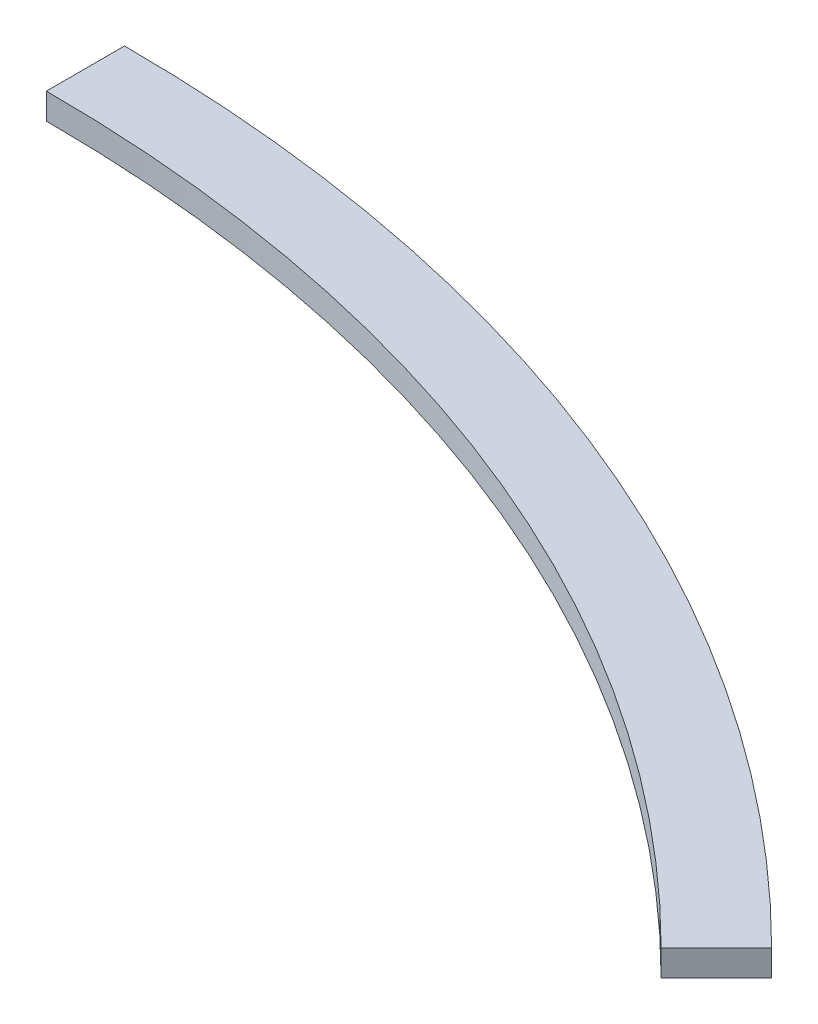
ISO-10303-21;
HEADER;
FILE_DESCRIPTION(('STEP AP214'),'2;1');
FILE_NAME('part.step','',(''),(''),'','','');
FILE_SCHEMA(('AUTOMOTIVE_DESIGN { 1 0 10303 214 1 1 1 1 }'));
ENDSEC;
DATA;
#1=APPLICATION_CONTEXT('core data for automotive mechanical design processes');
#2=APPLICATION_PROTOCOL_DEFINITION('international standard','automotive_design',2000,#1);
#3=PRODUCT_CONTEXT('',#1,'mechanical');
#4=PRODUCT('Part','Part','',(#3));
#5=PRODUCT_RELATED_PRODUCT_CATEGORY('part','',(#4));
#6=PRODUCT_DEFINITION_FORMATION('','',#4);
#7=PRODUCT_DEFINITION_CONTEXT('part definition',#1,'design');
#8=PRODUCT_DEFINITION('design','',#6,#7);
#9=PRODUCT_DEFINITION_SHAPE('','',#8);
#10=(LENGTH_UNIT() NAMED_UNIT(*) SI_UNIT(.MILLI.,.METRE.));
#11=(NAMED_UNIT(*) PLANE_ANGLE_UNIT() SI_UNIT($,.RADIAN.));
#12=(NAMED_UNIT(*) SI_UNIT($,.STERADIAN.) SOLID_ANGLE_UNIT());
#13=UNCERTAINTY_MEASURE_WITH_UNIT(LENGTH_MEASURE(1.E-05),#10,'distance_accuracy_value','');
#14=(GEOMETRIC_REPRESENTATION_CONTEXT(3) GLOBAL_UNCERTAINTY_ASSIGNED_CONTEXT((#13)) GLOBAL_UNIT_ASSIGNED_CONTEXT((#10,
#11,#12)) REPRESENTATION_CONTEXT('',''));
#15=CARTESIAN_POINT('',(0.,0.,0.));
#16=DIRECTION('',(0.,0.,1.));
#17=DIRECTION('',(1.,0.,0.));
#18=AXIS2_PLACEMENT_3D('',#15,#16,#17);
#19=CARTESIAN_POINT('',(0.,10.,0.));
#20=DIRECTION('',(0.,-1.,0.));
#21=DIRECTION('',(0.,0.,-1.));
#22=AXIS2_PLACEMENT_3D('',#19,#20,#21);
#23=CYLINDRICAL_SURFACE('',#22,570.);
#24=CARTESIAN_POINT('',(0.,0.,0.));
#25=DIRECTION('',(0.,-1.,0.));
#26=DIRECTION('',(0.,0.,-1.));
#27=AXIS2_PLACEMENT_3D('',#24,#25,#26);
#28=CIRCLE('',#27,570.);
#29=CARTESIAN_POINT('',(0.,0.,-570.));
#30=VERTEX_POINT('',#29);
#31=CARTESIAN_POINT('',(403.050865276333,0.,-403.050865276331));
#32=VERTEX_POINT('',#31);
#33=EDGE_CURVE('E97',#30,#32,#28,.T.);
#34=ORIENTED_EDGE('',*,*,#33,.T.);
#35=DIRECTION('',(0.,-1.,0.));
#36=VECTOR('',#35,1.);
#37=CARTESIAN_POINT('',(403.050865276333,10.,-403.050865276331));
#38=LINE('',#37,#36);
#39=CARTESIAN_POINT('',(403.050865276333,10.,-403.050865276331));
#40=VERTEX_POINT('',#39);
#41=EDGE_CURVE('E11',#40,#32,#38,.T.);
#42=ORIENTED_EDGE('',*,*,#41,.F.);
#43=CARTESIAN_POINT('',(0.,10.,0.));
#44=DIRECTION('',(0.,-1.,0.));
#45=DIRECTION('',(0.,0.,-1.));
#46=AXIS2_PLACEMENT_3D('',#43,#44,#45);
#47=CIRCLE('',#46,570.);
#48=CARTESIAN_POINT('',(0.,10.,-570.));
#49=VERTEX_POINT('',#48);
#50=EDGE_CURVE('E85',#49,#40,#47,.T.);
#51=ORIENTED_EDGE('',*,*,#50,.F.);
#52=DIRECTION('',(0.,-1.,0.));
#53=VECTOR('',#52,1.);
#54=CARTESIAN_POINT('',(0.,10.,-570.));
#55=LINE('',#54,#53);
#56=EDGE_CURVE('E93',#49,#30,#55,.T.);
#57=ORIENTED_EDGE('',*,*,#56,.T.);
#58=EDGE_LOOP('',(#34,#42,#51,#57));
#59=FACE_BOUND('',#58,.T.);
#60=ADVANCED_FACE('F34',(#59),#23,.F.);
#61=CARTESIAN_POINT('',(403.050865276333,10.,-403.050865276331));
#62=DIRECTION('',(-0.707106781186547,0.,-0.707106781186548));
#63=DIRECTION('',(-0.707106781186548,0.,0.707106781186547));
#64=AXIS2_PLACEMENT_3D('',#61,#62,#63);
#65=PLANE('',#64);
#66=DIRECTION('',(0.707106781186548,0.,-0.707106781186547));
#67=VECTOR('',#66,1.);
#68=CARTESIAN_POINT('',(403.050865276333,0.,-403.050865276331));
#69=LINE('',#68,#67);
#70=CARTESIAN_POINT('',(424.264068711929,0.,-424.264068711928));
#71=VERTEX_POINT('',#70);
#72=EDGE_CURVE('E89',#32,#71,#69,.T.);
#73=ORIENTED_EDGE('',*,*,#72,.T.);
#74=DIRECTION('',(0.,-1.,0.));
#75=VECTOR('',#74,1.);
#76=CARTESIAN_POINT('',(424.264068711929,10.,-424.264068711928));
#77=LINE('',#76,#75);
#78=CARTESIAN_POINT('',(424.264068711929,10.,-424.264068711928));
#79=VERTEX_POINT('',#78);
#80=EDGE_CURVE('E42',#79,#71,#77,.T.);
#81=ORIENTED_EDGE('',*,*,#80,.F.);
#82=DIRECTION('',(0.707106781186548,0.,-0.707106781186547));
#83=VECTOR('',#82,1.);
#84=CARTESIAN_POINT('',(403.050865276333,10.,-403.050865276331));
#85=LINE('',#84,#83);
#86=EDGE_CURVE('E80',#40,#79,#85,.T.);
#87=ORIENTED_EDGE('',*,*,#86,.F.);
#88=ORIENTED_EDGE('',*,*,#41,.T.);
#89=EDGE_LOOP('',(#73,#81,#87,#88));
#90=FACE_BOUND('',#89,.T.);
#91=ADVANCED_FACE('F88',(#90),#65,.F.);
#92=CARTESIAN_POINT('',(0.,10.,0.));
#93=DIRECTION('',(0.,-1.,0.));
#94=DIRECTION('',(0.,0.,-1.));
#95=AXIS2_PLACEMENT_3D('',#92,#93,#94);
#96=CYLINDRICAL_SURFACE('',#95,600.);
#97=CARTESIAN_POINT('',(0.,0.,0.));
#98=DIRECTION('',(0.,1.,0.));
#99=DIRECTION('',(0.,0.,-1.));
#100=AXIS2_PLACEMENT_3D('',#97,#98,#99);
#101=CIRCLE('',#100,600.);
#102=CARTESIAN_POINT('',(0.,0.,-600.));
#103=VERTEX_POINT('',#102);
#104=EDGE_CURVE('E67',#71,#103,#101,.T.);
#105=ORIENTED_EDGE('',*,*,#104,.T.);
#106=DIRECTION('',(0.,-1.,0.));
#107=VECTOR('',#106,1.);
#108=CARTESIAN_POINT('',(0.,10.,-600.));
#109=LINE('',#108,#107);
#110=CARTESIAN_POINT('',(0.,10.,-600.));
#111=VERTEX_POINT('',#110);
#112=EDGE_CURVE('E90',#111,#103,#109,.T.);
#113=ORIENTED_EDGE('',*,*,#112,.F.);
#114=CARTESIAN_POINT('',(0.,10.,0.));
#115=DIRECTION('',(0.,1.,0.));
#116=DIRECTION('',(0.,0.,-1.));
#117=AXIS2_PLACEMENT_3D('',#114,#115,#116);
#118=CIRCLE('',#117,600.);
#119=EDGE_CURVE('E83',#79,#111,#118,.T.);
#120=ORIENTED_EDGE('',*,*,#119,.F.);
#121=ORIENTED_EDGE('',*,*,#80,.T.);
#122=EDGE_LOOP('',(#105,#113,#120,#121));
#123=FACE_BOUND('',#122,.T.);
#124=ADVANCED_FACE('F91',(#123),#96,.T.);
#125=CARTESIAN_POINT('',(0.,10.,-570.));
#126=DIRECTION('',(1.,0.,0.));
#127=DIRECTION('',(0.,0.,-1.));
#128=AXIS2_PLACEMENT_3D('',#125,#126,#127);
#129=PLANE('',#128);
#130=DIRECTION('',(0.,0.,1.));
#131=VECTOR('',#130,1.);
#132=CARTESIAN_POINT('',(0.,0.,-570.));
#133=LINE('',#132,#131);
#134=EDGE_CURVE('E73',#103,#30,#133,.T.);
#135=ORIENTED_EDGE('',*,*,#134,.T.);
#136=ORIENTED_EDGE('',*,*,#56,.F.);
#137=DIRECTION('',(0.,0.,1.));
#138=VECTOR('',#137,1.);
#139=CARTESIAN_POINT('',(0.,10.,-570.));
#140=LINE('',#139,#138);
#141=EDGE_CURVE('E50',#111,#49,#140,.T.);
#142=ORIENTED_EDGE('',*,*,#141,.F.);
#143=ORIENTED_EDGE('',*,*,#112,.T.);
#144=EDGE_LOOP('',(#135,#136,#142,#143));
#145=FACE_BOUND('',#144,.T.);
#146=ADVANCED_FACE('F104',(#145),#129,.F.);
#147=CARTESIAN_POINT('',(0.,10.,0.));
#148=DIRECTION('',(0.,-1.,0.));
#149=DIRECTION('',(0.,0.,-1.));
#150=AXIS2_PLACEMENT_3D('',#147,#148,#149);
#151=PLANE('',#150);
#152=ORIENTED_EDGE('',*,*,#50,.T.);
#153=ORIENTED_EDGE('',*,*,#86,.T.);
#154=ORIENTED_EDGE('',*,*,#119,.T.);
#155=ORIENTED_EDGE('',*,*,#141,.T.);
#156=EDGE_LOOP('',(#152,#153,#154,#155));
#157=FACE_BOUND('',#156,.T.);
#158=ADVANCED_FACE('F81',(#157),#151,.F.);
#159=CARTESIAN_POINT('',(0.,0.,0.));
#160=DIRECTION('',(0.,-1.,0.));
#161=DIRECTION('',(0.,0.,-1.));
#162=AXIS2_PLACEMENT_3D('',#159,#160,#161);
#163=PLANE('',#162);
#164=ORIENTED_EDGE('',*,*,#33,.F.);
#165=ORIENTED_EDGE('',*,*,#134,.F.);
#166=ORIENTED_EDGE('',*,*,#104,.F.);
#167=ORIENTED_EDGE('',*,*,#72,.F.);
#168=EDGE_LOOP('',(#164,#165,#166,#167));
#169=FACE_BOUND('',#168,.T.);
#170=ADVANCED_FACE('F107',(#169),#163,.T.);
#171=CLOSED_SHELL('',(#60,#91,#124,#146,#158,#170));
#172=MANIFOLD_SOLID_BREP('B2',#171);
#173=ADVANCED_BREP_SHAPE_REPRESENTATION('',(#18,#172),#14);
#174=SHAPE_DEFINITION_REPRESENTATION(#9,#173);
ENDSEC;
END-ISO-10303-21;
